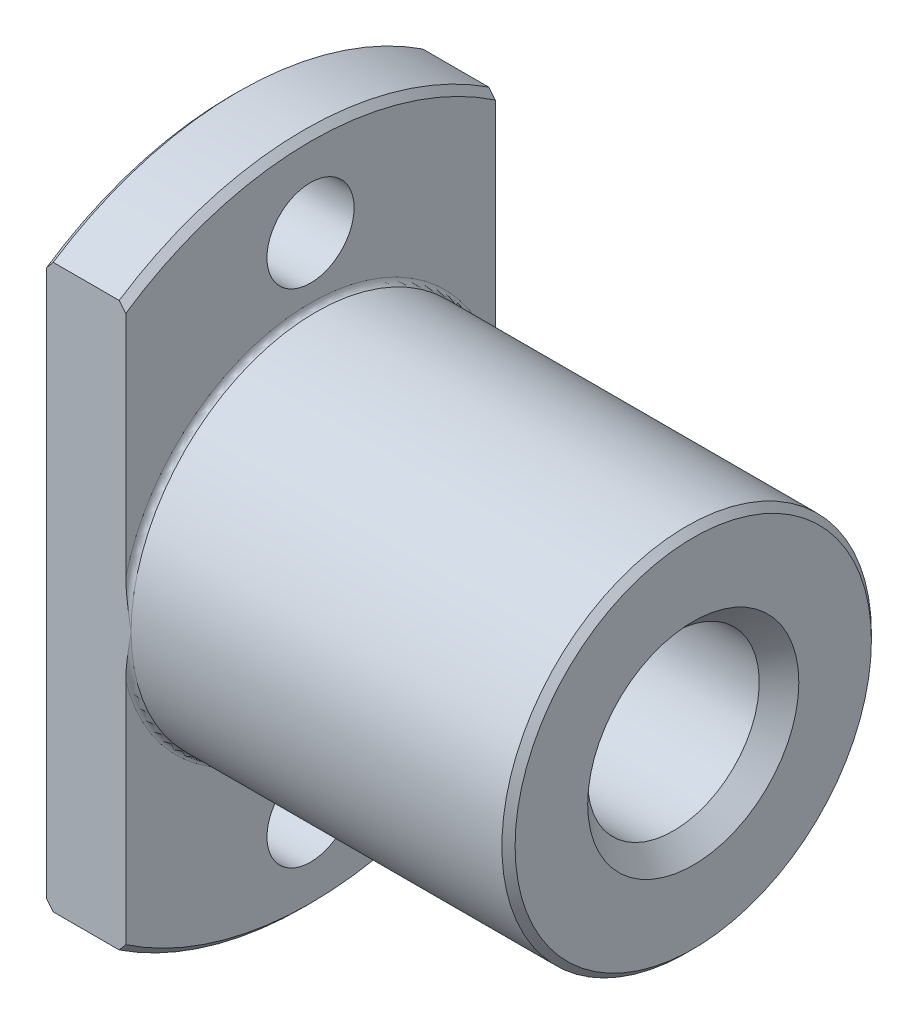
ISO-10303-21;
HEADER;
FILE_DESCRIPTION(('STEP AP214'),'2;1');
FILE_NAME('part.step','',(''),(''),'','','');
FILE_SCHEMA(('AUTOMOTIVE_DESIGN { 1 0 10303 214 1 1 1 1 }'));
ENDSEC;
DATA;
#1=APPLICATION_CONTEXT('core data for automotive mechanical design processes');
#2=APPLICATION_PROTOCOL_DEFINITION('international standard','automotive_design',2000,#1);
#3=PRODUCT_CONTEXT('',#1,'mechanical');
#4=PRODUCT('Part','Part','',(#3));
#5=PRODUCT_RELATED_PRODUCT_CATEGORY('part','',(#4));
#6=PRODUCT_DEFINITION_FORMATION('','',#4);
#7=PRODUCT_DEFINITION_CONTEXT('part definition',#1,'design');
#8=PRODUCT_DEFINITION('design','',#6,#7);
#9=PRODUCT_DEFINITION_SHAPE('','',#8);
#10=(LENGTH_UNIT() NAMED_UNIT(*) SI_UNIT(.MILLI.,.METRE.));
#11=(NAMED_UNIT(*) PLANE_ANGLE_UNIT() SI_UNIT($,.RADIAN.));
#12=(NAMED_UNIT(*) SI_UNIT($,.STERADIAN.) SOLID_ANGLE_UNIT());
#13=UNCERTAINTY_MEASURE_WITH_UNIT(LENGTH_MEASURE(1.E-05),#10,'distance_accuracy_value','');
#14=(GEOMETRIC_REPRESENTATION_CONTEXT(3) GLOBAL_UNCERTAINTY_ASSIGNED_CONTEXT((#13)) GLOBAL_UNIT_ASSIGNED_CONTEXT((#10,
#11,#12)) REPRESENTATION_CONTEXT('',''));
#15=CARTESIAN_POINT('',(0.,0.,0.));
#16=DIRECTION('',(0.,0.,1.));
#17=DIRECTION('',(1.,0.,0.));
#18=AXIS2_PLACEMENT_3D('',#15,#16,#17);
#19=CARTESIAN_POINT('',(0.499999999999405,0.,0.));
#20=DIRECTION('',(1.,0.,0.));
#21=DIRECTION('',(0.,-0.828492607116294,0.559999999958613));
#22=AXIS2_PLACEMENT_3D('',#19,#20,#21);
#23=CONICAL_SURFACE('',#22,25.4999999999994,0.785398163397448);
#24=CARTESIAN_POINT('',(0.,0.,0.));
#25=DIRECTION('',(1.,0.,0.));
#26=DIRECTION('',(0.,-0.828492607116294,0.559999999958613));
#27=AXIS2_PLACEMENT_3D('',#24,#25,#26);
#28=CIRCLE('',#27,25.);
#29=CARTESIAN_POINT('',(0.,-20.7123151779073,13.9999999989653));
#30=VERTEX_POINT('',#29);
#31=CARTESIAN_POINT('',(0.,-20.712315177208,-14.));
#32=VERTEX_POINT('',#31);
#33=EDGE_CURVE('E113',#30,#32,#28,.T.);
#34=ORIENTED_EDGE('',*,*,#33,.T.);
#35=CARTESIAN_POINT('',(0.,-20.712315177208,-14.));
#36=CARTESIAN_POINT('',(0.0207764515539653,-20.7373925900107,-14.0000000000205));
#37=CARTESIAN_POINT('',(0.0415599192445983,-20.7624641898695,-14.0000000000796));
#38=CARTESIAN_POINT('',(0.0831421654218376,-20.8125975546564,-14.0000000001959));
#39=CARTESIAN_POINT('',(0.103940944849708,-20.8376593188039,-14.000000000253));
#40=CARTESIAN_POINT('',(0.14555328530448,-20.8877726185182,-14.0000000002862));
#41=CARTESIAN_POINT('',(0.166366846997098,-20.9128241535322,-14.0000000002622));
#42=CARTESIAN_POINT('',(0.208008223217808,-20.9629166004068,-14.0000000001588));
#43=CARTESIAN_POINT('',(0.228836038140765,-20.9879575119392,-14.0000000000794));
#44=CARTESIAN_POINT('',(0.270505391929723,-21.038028316722,-13.9999999999206));
#45=CARTESIAN_POINT('',(0.291346930924344,-21.0630582098654,-13.9999999998413));
#46=CARTESIAN_POINT('',(0.33304320401818,-21.1131065820927,-13.9999999997382));
#47=CARTESIAN_POINT('',(0.353897937984325,-21.1381250612875,-13.9999999997145));
#48=CARTESIAN_POINT('',(0.395620072067997,-21.1881502093141,-13.9999999997478));
#49=CARTESIAN_POINT('',(0.416487471795262,-21.2131568784716,-13.9999999998049));
#50=CARTESIAN_POINT('',(0.458234408825642,-21.263158009309,-13.9999999999208));
#51=CARTESIAN_POINT('',(0.479113945485732,-21.2881524715259,-13.9999999999797));
#52=CARTESIAN_POINT('',(0.499999999999404,-21.3131414859464,-14.));
#53=B_SPLINE_CURVE_WITH_KNOTS('',3,(#35,#36,#37,#38,#39,#40,#41,#42,#43,#44,#45,#46,#47,#48,#49,
#50,#51,#52),.UNSPECIFIED.,.F.,.F.,(4,2,2,2,2,2,2,2,4),(0.,0.0976976861112168,0.195401986195182,
0.293111007579408,0.390822855304759,0.48853563218424,0.58624743886064,0.683956373863065,
0.781660533662384),.UNSPECIFIED.);
#54=CARTESIAN_POINT('',(0.499999999999404,-21.3131414859464,-14.));
#55=VERTEX_POINT('',#54);
#56=EDGE_CURVE('E99',#32,#55,#53,.T.);
#57=ORIENTED_EDGE('',*,*,#56,.T.);
#58=CARTESIAN_POINT('',(0.499999999999404,0.,0.));
#59=DIRECTION('',(-1.,0.,0.));
#60=DIRECTION('',(0.,-0.835809470037133,-0.54901960784315));
#61=AXIS2_PLACEMENT_3D('',#58,#59,#60);
#62=CIRCLE('',#61,25.4999999999994);
#63=CARTESIAN_POINT('',(0.499999999999404,-21.3131414859448,14.0000000000024));
#64=VERTEX_POINT('',#63);
#65=EDGE_CURVE('E112',#64,#55,#62,.F.);
#66=ORIENTED_EDGE('',*,*,#65,.F.);
#67=CARTESIAN_POINT('',(0.499999999996271,-21.3131414859422,14.0000000000007));
#68=CARTESIAN_POINT('',(0.479113247198307,-21.2881516360594,13.9999999999857));
#69=CARTESIAN_POINT('',(0.458233012689595,-21.2631563380162,13.9999999999317));
#70=CARTESIAN_POINT('',(0.41648488490307,-21.2131537791928,13.9999999998241));
#71=CARTESIAN_POINT('',(0.395616992139673,-21.1881465179832,13.9999999997706));
#72=CARTESIAN_POINT('',(0.353894074221933,-21.1381204270477,13.9999999997427));
#73=CARTESIAN_POINT('',(0.333039049329527,-21.1131015971034,13.9999999997683));
#74=CARTESIAN_POINT('',(0.291342393918546,-21.0630527621024,13.9999999998733));
#75=CARTESIAN_POINT('',(0.27050076340502,-21.0380227570415,13.9999999999528));
#76=CARTESIAN_POINT('',(0.22883142341076,-20.9879519646805,14.0000000001106));
#77=CARTESIAN_POINT('',(0.208003713673707,-20.9629111775936,14.0000000001889));
#78=CARTESIAN_POINT('',(0.166362741954434,-20.9128192133995,14.0000000002891));
#79=CARTESIAN_POINT('',(0.145549479449991,-20.8877680367262,14.000000000311));
#80=CARTESIAN_POINT('',(0.103937928798313,-20.8376556850171,14.0000000002727));
#81=CARTESIAN_POINT('',(0.0831396398583682,-20.8125945106394,14.0000000002126));
#82=CARTESIAN_POINT('',(0.0415585633807263,-20.7624625542513,14.000000000089));
#83=CARTESIAN_POINT('',(0.0207757747751494,-20.7373917731267,14.0000000000256));
#84=CARTESIAN_POINT('',(1.8476476858903E-09,-20.7123151794381,14.));
#85=B_SPLINE_CURVE_WITH_KNOTS('',3,(#67,#68,#69,#70,#71,#72,#73,#74,#75,#76,#77,#78,#79,#80,#81,
#82,#83,#84),.UNSPECIFIED.,.F.,.F.,(4,2,2,2,2,2,2,2,4),(0.,0.0977074263544266,0.195418672738843,
0.293131846513834,0.390845057093864,0.488556416002452,0.586264036928512,0.68396603578371,
0.781660530761051),.UNSPECIFIED.);
#86=EDGE_CURVE('E127',#64,#30,#85,.T.);
#87=ORIENTED_EDGE('',*,*,#86,.T.);
#88=EDGE_LOOP('',(#34,#57,#66,#87));
#89=FACE_BOUND('',#88,.T.);
#90=ADVANCED_FACE('F16',(#89),#23,.T.);
#91=CARTESIAN_POINT('',(35.,0.,0.));
#92=DIRECTION('',(1.,0.,0.));
#93=DIRECTION('',(0.,-0.835809470037071,0.549019607843245));
#94=AXIS2_PLACEMENT_3D('',#91,#92,#93);
#95=CYLINDRICAL_SURFACE('',#94,25.5);
#96=ORIENTED_EDGE('',*,*,#65,.T.);
#97=DIRECTION('',(1.,0.,0.));
#98=VECTOR('',#97,1.);
#99=CARTESIAN_POINT('',(0.499999999999403,-21.3131414859469,-14.0000000000003));
#100=LINE('',#99,#98);
#101=CARTESIAN_POINT('',(5.50000000000091,-21.3131414859468,-14.0000000000005));
#102=VERTEX_POINT('',#101);
#103=EDGE_CURVE('E106',#55,#102,#100,.T.);
#104=ORIENTED_EDGE('',*,*,#103,.T.);
#105=CARTESIAN_POINT('',(5.50000000000091,0.,0.));
#106=DIRECTION('',(-1.,0.,0.));
#107=DIRECTION('',(0.,-0.835809470037129,-0.549019607843157));
#108=AXIS2_PLACEMENT_3D('',#105,#106,#107);
#109=CIRCLE('',#108,25.5);
#110=CARTESIAN_POINT('',(5.50000000000091,-21.3131414859469,14.0000000000003));
#111=VERTEX_POINT('',#110);
#112=EDGE_CURVE('E159',#111,#102,#109,.F.);
#113=ORIENTED_EDGE('',*,*,#112,.F.);
#114=DIRECTION('',(-1.,3.23296944770491E-13,4.9240611588121E-13));
#115=VECTOR('',#114,1.);
#116=CARTESIAN_POINT('',(5.5000000000005,-21.3131414859469,14.0000000000003));
#117=LINE('',#116,#115);
#118=EDGE_CURVE('E164',#111,#64,#117,.T.);
#119=ORIENTED_EDGE('',*,*,#118,.T.);
#120=EDGE_LOOP('',(#96,#104,#113,#119));
#121=FACE_BOUND('',#120,.T.);
#122=ADVANCED_FACE('F146',(#121),#95,.T.);
#123=CARTESIAN_POINT('',(5.50000000000037,0.,0.));
#124=DIRECTION('',(-1.,0.,0.));
#125=DIRECTION('',(0.,-0.828492607120559,-0.559999999952302));
#126=AXIS2_PLACEMENT_3D('',#123,#124,#125);
#127=CONICAL_SURFACE('',#126,25.4999999999996,0.785398163397446);
#128=ORIENTED_EDGE('',*,*,#112,.T.);
#129=CARTESIAN_POINT('',(5.50000000000068,-21.3131414859462,-14.0000000000001));
#130=CARTESIAN_POINT('',(5.52088675278705,-21.2881516360775,-13.9999999999849));
#131=CARTESIAN_POINT('',(5.54176698728416,-21.2631563380483,-13.9999999999306));
#132=CARTESIAN_POINT('',(5.58351511504746,-21.2131537792531,-13.9999999998226));
#133=CARTESIAN_POINT('',(5.60438300779923,-21.1881465180576,-13.9999999997689));
#134=CARTESIAN_POINT('',(5.64610592569371,-21.1381204271502,-13.9999999997407));
#135=CARTESIAN_POINT('',(5.66696095057448,-21.1131015972199,-13.9999999997662));
#136=CARTESIAN_POINT('',(5.70865760596218,-21.0630527622471,-13.9999999998711));
#137=CARTESIAN_POINT('',(5.72949923646407,-21.0380227572002,-13.9999999999506));
#138=CARTESIAN_POINT('',(5.77116857643506,-20.9879519648672,-14.0000000001085));
#139=CARTESIAN_POINT('',(5.79199628616048,-20.9629111777944,-14.0000000001868));
#140=CARTESIAN_POINT('',(5.83363725785651,-20.9128192136282,-14.0000000002872));
#141=CARTESIAN_POINT('',(5.85445052034934,-20.887768036969,-14.0000000003092));
#142=CARTESIAN_POINT('',(5.89606207097782,-20.8376556852877,-14.0000000002713));
#143=CARTESIAN_POINT('',(5.91686035990617,-20.8125945109239,-14.0000000002114));
#144=CARTESIAN_POINT('',(5.95844143636067,-20.7624625545636,-14.0000000000884));
#145=CARTESIAN_POINT('',(5.9792242249547,-20.7373917734528,-14.0000000000253));
#146=CARTESIAN_POINT('',(5.99999999787064,-20.7123151797781,-14.));
#147=B_SPLINE_CURVE_WITH_KNOTS('',3,(#129,#130,#131,#132,#133,#134,#135,#136,#137,#138,#139,
#140,#141,#142,#143,#144,#145,#146),.UNSPECIFIED.,.F.,.F.,(4,2,2,2,2,2,2,2,4),(0.,
0.0977074262997272,0.195418672629386,0.293131846349614,0.390845056874921,0.488556415728873,
0.586264036600422,0.68396603540129,0.781660530324517),.UNSPECIFIED.);
#148=CARTESIAN_POINT('',(6.,-20.712315178014,-13.9999999988076));
#149=VERTEX_POINT('',#148);
#150=EDGE_CURVE('E169',#102,#149,#147,.T.);
#151=ORIENTED_EDGE('',*,*,#150,.T.);
#152=CARTESIAN_POINT('',(6.,0.,0.));
#153=DIRECTION('',(-1.,0.,0.));
#154=DIRECTION('',(0.,-0.828492607120559,-0.559999999952302));
#155=AXIS2_PLACEMENT_3D('',#152,#153,#154);
#156=CIRCLE('',#155,25.);
#157=CARTESIAN_POINT('',(6.,-20.712315177208,14.));
#158=VERTEX_POINT('',#157);
#159=EDGE_CURVE('E180',#158,#149,#156,.F.);
#160=ORIENTED_EDGE('',*,*,#159,.F.);
#161=CARTESIAN_POINT('',(6.,-20.712315177208,14.));
#162=CARTESIAN_POINT('',(5.97922354844607,-20.7373925900106,14.0000000000205));
#163=CARTESIAN_POINT('',(5.95844008075548,-20.7624641898694,14.0000000000796));
#164=CARTESIAN_POINT('',(5.91685783457828,-20.8125975546563,14.0000000001959));
#165=CARTESIAN_POINT('',(5.89605905515041,-20.8376593188038,14.0000000002531));
#166=CARTESIAN_POINT('',(5.85444671469561,-20.8877726185181,14.0000000002862));
#167=CARTESIAN_POINT('',(5.83363315300296,-20.9128241535321,14.0000000002622));
#168=CARTESIAN_POINT('',(5.79199177678217,-20.9629166004068,14.0000000001588));
#169=CARTESIAN_POINT('',(5.77116396185918,-20.9879575119392,14.0000000000794));
#170=CARTESIAN_POINT('',(5.72949460807013,-21.0380283167222,13.9999999999207));
#171=CARTESIAN_POINT('',(5.70865306907547,-21.0630582098656,13.9999999998414));
#172=CARTESIAN_POINT('',(5.66695679598156,-21.113106582093,13.9999999997383));
#173=CARTESIAN_POINT('',(5.64610206201538,-21.1381250612878,13.9999999997145));
#174=CARTESIAN_POINT('',(5.60437992793167,-21.1881502093145,13.9999999997478));
#175=CARTESIAN_POINT('',(5.58351252820441,-21.2131568784719,13.9999999998049));
#176=CARTESIAN_POINT('',(5.54176559117406,-21.2631580093093,13.9999999999209));
#177=CARTESIAN_POINT('',(5.52088605451401,-21.2881524715261,13.9999999999798));
#178=CARTESIAN_POINT('',(5.50000000000037,-21.3131414859466,14.0000000000001));
#179=B_SPLINE_CURVE_WITH_KNOTS('',3,(#161,#162,#163,#164,#165,#166,#167,#168,#169,#170,#171,
#172,#173,#174,#175,#176,#177,#178),.UNSPECIFIED.,.F.,.F.,(4,2,2,2,2,2,2,2,4),(0.,
0.097697686111021,0.195401986194994,0.293111007579348,0.390822855304899,0.488535632184585,
0.586247438861121,0.683956373863554,0.781660533662693),.UNSPECIFIED.);
#180=EDGE_CURVE('E209',#158,#111,#179,.T.);
#181=ORIENTED_EDGE('',*,*,#180,.T.);
#182=EDGE_LOOP('',(#128,#151,#160,#181));
#183=FACE_BOUND('',#182,.T.);
#184=ADVANCED_FACE('F182',(#183),#127,.T.);
#185=CARTESIAN_POINT('',(6.,-25.0000000017144,-14.));
#186=DIRECTION('',(1.,0.,0.));
#187=DIRECTION('',(0.,1.,0.));
#188=AXIS2_PLACEMENT_3D('',#185,#186,#187);
#189=PLANE('',#188);
#190=ORIENTED_EDGE('',*,*,#159,.T.);
#191=DIRECTION('',(0.,1.,0.));
#192=VECTOR('',#191,1.);
#193=CARTESIAN_POINT('',(6.,-20.7123151797781,-14.));
#194=LINE('',#193,#192);
#195=CARTESIAN_POINT('',(6.,-3.37045994540488,-14.));
#196=VERTEX_POINT('',#195);
#197=EDGE_CURVE('E200',#149,#196,#194,.T.);
#198=ORIENTED_EDGE('',*,*,#197,.T.);
#199=CARTESIAN_POINT('',(6.,0.,0.));
#200=DIRECTION('',(-1.,0.,0.));
#201=DIRECTION('',(0.,-0.234059718293423,-0.972222221651204));
#202=AXIS2_PLACEMENT_3D('',#199,#200,#201);
#203=CIRCLE('',#202,14.4000000412947);
#204=CARTESIAN_POINT('',(6.,-3.37046007545168,14.0000000024669));
#205=VERTEX_POINT('',#204);
#206=EDGE_CURVE('E208',#205,#196,#203,.F.);
#207=ORIENTED_EDGE('',*,*,#206,.F.);
#208=DIRECTION('',(0.,-1.,0.));
#209=VECTOR('',#208,1.);
#210=CARTESIAN_POINT('',(6.,-3.37046007485777,14.));
#211=LINE('',#210,#209);
#212=EDGE_CURVE('E214',#205,#158,#211,.T.);
#213=ORIENTED_EDGE('',*,*,#212,.T.);
#214=EDGE_LOOP('',(#190,#198,#207,#213));
#215=FACE_BOUND('',#214,.T.);
#216=CARTESIAN_POINT('',(6.,-19.,0.));
#217=DIRECTION('',(-1.,0.,0.));
#218=DIRECTION('',(0.,0.,-1.));
#219=AXIS2_PLACEMENT_3D('',#216,#217,#218);
#220=CIRCLE('',#219,3.3);
#221=CARTESIAN_POINT('',(6.,-19.,-3.3));
#222=VERTEX_POINT('',#221);
#223=EDGE_CURVE('E219',#222,#222,#220,.F.);
#224=ORIENTED_EDGE('',*,*,#223,.F.);
#225=EDGE_LOOP('',(#224));
#226=FACE_BOUND('',#225,.T.);
#227=ADVANCED_FACE('F191',(#215,#226),#189,.T.);
#228=CARTESIAN_POINT('',(6.39999999999938,0.,0.));
#229=DIRECTION('',(1.,0.,0.));
#230=DIRECTION('',(0.,0.,1.));
#231=AXIS2_PLACEMENT_3D('',#228,#229,#230);
#232=TOROIDAL_SURFACE('',#231,14.3999999999994,0.399999999999383);
#233=ORIENTED_EDGE('',*,*,#206,.T.);
#234=CARTESIAN_POINT('',(6.,-3.37045994540488,-14.));
#235=CARTESIAN_POINT('',(6.00001199548021,-3.3019342984978,-14.0000020840903));
#236=CARTESIAN_POINT('',(6.00096411883622,-3.23341540150265,-14.0000069486083));
#237=CARTESIAN_POINT('',(6.0045649171859,-3.09423312842194,-14.0000168041844));
#238=CARTESIAN_POINT('',(6.007266761912,-3.02357109433435,-14.0000217943269));
#239=CARTESIAN_POINT('',(6.0142284018148,-2.8807708548042,-14.0000256449359));
#240=CARTESIAN_POINT('',(6.01852110625671,-2.80863430837604,-14.00002436839));
#241=CARTESIAN_POINT('',(6.02850608897532,-2.6635309759947,-14.000017897332));
#242=CARTESIAN_POINT('',(6.03421558476385,-2.59056538678142,-14.0000126528602));
#243=CARTESIAN_POINT('',(6.04684196246574,-2.44443414979246,-14.0000017206226));
#244=CARTESIAN_POINT('',(6.05376376531026,-2.37126893143813,-13.9999960311045));
#245=CARTESIAN_POINT('',(6.06860356224121,-2.22535307948301,-13.9999875109145));
#246=CARTESIAN_POINT('',(6.07651721699287,-2.15260200163584,-13.9999846682472));
#247=CARTESIAN_POINT('',(6.09311751993652,-2.00811672331483,-13.99998288052));
#248=CARTESIAN_POINT('',(6.10179317993433,-1.93638125352284,-13.9999838868325));
#249=CARTESIAN_POINT('',(6.11968979260832,-1.79452005943164,-13.9999888028308));
#250=CARTESIAN_POINT('',(6.12889532874875,-1.72439238224327,-13.9999926506511));
#251=CARTESIAN_POINT('',(6.14763395845667,-1.58630631036396,-13.9999978495603));
#252=CARTESIAN_POINT('',(6.15714914626011,-1.51834547770449,-13.9999992715563));
#253=CARTESIAN_POINT('',(6.176615147099,-1.38288119283514,-14.0000007728122));
#254=CARTESIAN_POINT('',(6.18656317253572,-1.31537733891754,-14.0000008596683));
#255=CARTESIAN_POINT('',(6.20698568216251,-1.17963173664275,-14.0000014769856));
#256=CARTESIAN_POINT('',(6.2174650062542,-1.11139071823519,-14.0000020126887));
#257=CARTESIAN_POINT('',(6.23886922070522,-0.974303620495062,-14.0000025252452));
#258=CARTESIAN_POINT('',(6.24979743643951,-0.90545806155438,-14.0000024966522));
#259=CARTESIAN_POINT('',(6.27201355977399,-0.767291538827652,-14.0000021839038));
#260=CARTESIAN_POINT('',(6.28330356091112,-0.69797091242104,-14.0000018978194));
#261=CARTESIAN_POINT('',(6.30615471682222,-0.558981495776463,-14.0000012608565));
#262=CARTESIAN_POINT('',(6.31771702418588,-0.489312895424487,-14.0000009096291));
#263=CARTESIAN_POINT('',(6.34102183740367,-0.349752885400569,-14.0000003765134));
#264=CARTESIAN_POINT('',(6.35276483557448,-0.279861558145215,-14.0000001952277));
#265=CARTESIAN_POINT('',(6.37633874738332,-0.139980163940773,-13.9999999863575));
#266=CARTESIAN_POINT('',(6.38816977060455,-0.0699901154403926,-13.9999999590162));
#267=CARTESIAN_POINT('',(6.39999999999954,0.,-14.));
#268=B_SPLINE_CURVE_WITH_KNOTS('',3,(#234,#235,#236,#237,#238,#239,#240,#241,#242,#243,#244,
#245,#246,#247,#248,#249,#250,#251,#252,#253,#254,#255,#256,#257,#258,#259,#260,#261,#262,#263,
#264,#265,#266,#267),.UNSPECIFIED.,.F.,.F.,(4,2,2,2,2,2,2,2,2,2,2,2,2,2,2,2,4),(0.,
0.205560956527259,0.417681648119563,0.63446045339531,0.854015083562403,1.07448249523406,
1.2940169964309,1.51078714542077,1.72297194575961,1.92884098690511,2.13353832039423,
2.34066011479056,2.54978192987893,2.76048347311392,2.97234784794462,3.18496073351481,
3.3979095138643),.UNSPECIFIED.);
#269=CARTESIAN_POINT('',(6.39999999999954,0.,-14.));
#270=VERTEX_POINT('',#269);
#271=EDGE_CURVE('E224',#196,#270,#268,.T.);
#272=ORIENTED_EDGE('',*,*,#271,.T.);
#273=CARTESIAN_POINT('',(6.39999999999954,0.,0.));
#274=DIRECTION('',(-1.,0.,0.));
#275=DIRECTION('',(0.,0.,-1.));
#276=AXIS2_PLACEMENT_3D('',#273,#274,#275);
#277=CIRCLE('',#276,14.);
#278=CARTESIAN_POINT('',(6.39999999999954,0.,14.));
#279=VERTEX_POINT('',#278);
#280=EDGE_CURVE('E233',#279,#270,#277,.F.);
#281=ORIENTED_EDGE('',*,*,#280,.F.);
#282=CARTESIAN_POINT('',(6.39999999999984,0.,14.));
#283=CARTESIAN_POINT('',(6.38758921224068,-0.0734276151248544,14.0000001463741));
#284=CARTESIAN_POINT('',(6.37517917557478,-0.146855441635416,13.9999999566074));
#285=CARTESIAN_POINT('',(6.35030191173671,-0.294545045882363,13.9999993023027));
#286=CARTESIAN_POINT('',(6.33783559431114,-0.368806976692691,13.999998834719));
#287=CARTESIAN_POINT('',(6.31297886204904,-0.517892724583124,13.9999980341931));
#288=CARTESIAN_POINT('',(6.30058963830252,-0.592716740807022,13.9999977022436));
#289=CARTESIAN_POINT('',(6.27602640522691,-0.742655206101763,13.9999977847889));
#290=CARTESIAN_POINT('',(6.26385324665391,-0.817769794887734,13.9999982017648));
#291=CARTESIAN_POINT('',(6.23986395210174,-0.968016917928702,13.9999998365794));
#292=CARTESIAN_POINT('',(6.22804763760098,-1.04314942360213,14.0000010540105));
#293=CARTESIAN_POINT('',(6.20491385304079,-1.19315729290814,14.0000037219838));
#294=CARTESIAN_POINT('',(6.1935944390687,-1.26803235587974,14.0000051714904));
#295=CARTESIAN_POINT('',(6.1715933809221,-1.41724609520561,14.0000072880336));
#296=CARTESIAN_POINT('',(6.16090725035265,-1.49158410796147,14.000007961419));
#297=CARTESIAN_POINT('',(6.14030587351966,-1.63943890239359,14.0000078136721));
#298=CARTESIAN_POINT('',(6.13038278701876,-1.71295458783578,14.0000070107482));
#299=CARTESIAN_POINT('',(6.11143238326035,-1.85887307964716,14.0000039741963));
#300=CARTESIAN_POINT('',(6.10239302306752,-1.93127431597775,14.000001764302));
#301=CARTESIAN_POINT('',(6.08532389171154,-2.07465636360537,13.9999998558974));
#302=CARTESIAN_POINT('',(6.07727692248373,-2.14563511840796,14.0000001056876));
#303=CARTESIAN_POINT('',(6.06229228354908,-2.28590197084464,14.0000043763422));
#304=CARTESIAN_POINT('',(6.05533177581114,-2.35518761522392,14.00000830205));
#305=CARTESIAN_POINT('',(6.0425970745944,-2.49190808471307,14.0000160095064));
#306=CARTESIAN_POINT('',(6.0367950784332,-2.5593403032211,14.0000197922039));
#307=CARTESIAN_POINT('',(6.02644169555857,-2.69219405580088,14.000024936833));
#308=CARTESIAN_POINT('',(6.02185705675588,-2.75761297486051,14.0000263703177));
#309=CARTESIAN_POINT('',(6.01399264473003,-2.88627281735054,14.0000256936868));
#310=CARTESIAN_POINT('',(6.01067343397361,-2.9495113073195,14.0000237036891));
#311=CARTESIAN_POINT('',(6.00537950664984,-3.07363681458816,14.0000168145081));
#312=CARTESIAN_POINT('',(6.00335845942475,-3.13452179764983,14.0000120288395));
#313=CARTESIAN_POINT('',(6.00069938581939,-3.25375741061097,14.0000040342315));
#314=CARTESIAN_POINT('',(6.00000672855666,-3.31210684963121,14.0000007674058));
#315=CARTESIAN_POINT('',(6.,-3.37046007485777,14.));
#316=B_SPLINE_CURVE_WITH_KNOTS('',3,(#282,#283,#284,#285,#286,#287,#288,#289,#290,#291,#292,
#293,#294,#295,#296,#297,#298,#299,#300,#301,#302,#303,#304,#305,#306,#307,#308,#309,#310,#311,
#312,#313,#314,#315),.UNSPECIFIED.,.F.,.F.,(4,2,2,2,2,2,2,2,2,2,2,2,2,2,2,2,4),(0.,
0.223407348770703,0.449310338269671,0.676838358414336,0.905121530829563,1.13328853960588,
1.36046444258873,1.58576855062832,1.80831246555987,2.02719836917487,2.24149355521817,
2.45039038107051,2.65342683397589,2.85015572415542,3.04012202406451,3.22286389604791,
3.39791416898308),.UNSPECIFIED.);
#317=EDGE_CURVE('E258',#279,#205,#316,.T.);
#318=ORIENTED_EDGE('',*,*,#317,.T.);
#319=EDGE_LOOP('',(#233,#272,#281,#318));
#320=FACE_BOUND('',#319,.T.);
#321=ADVANCED_FACE('F235',(#320),#232,.F.);
#322=CARTESIAN_POINT('',(0.,-26.4292282758045,14.));
#323=DIRECTION('',(-1.,0.,0.));
#324=DIRECTION('',(0.,1.,0.));
#325=AXIS2_PLACEMENT_3D('',#322,#323,#324);
#326=PLANE('',#325);
#327=CARTESIAN_POINT('',(0.,0.,0.));
#328=DIRECTION('',(-1.,0.,0.));
#329=DIRECTION('',(0.,0.82849260708832,0.559999999999999));
#330=AXIS2_PLACEMENT_3D('',#327,#328,#329);
#331=CIRCLE('',#330,25.);
#332=CARTESIAN_POINT('',(0.,20.7123151772998,-13.9999999998642));
#333=VERTEX_POINT('',#332);
#334=CARTESIAN_POINT('',(0.,20.712315177208,14.));
#335=VERTEX_POINT('',#334);
#336=EDGE_CURVE('E123',#333,#335,#331,.F.);
#337=ORIENTED_EDGE('',*,*,#336,.F.);
#338=DIRECTION('',(0.,-1.,0.));
#339=VECTOR('',#338,1.);
#340=CARTESIAN_POINT('',(0.,20.7123151775006,-14.));
#341=LINE('',#340,#339);
#342=EDGE_CURVE('E103',#333,#32,#341,.T.);
#343=ORIENTED_EDGE('',*,*,#342,.T.);
#344=ORIENTED_EDGE('',*,*,#33,.F.);
#345=DIRECTION('',(0.,1.,0.));
#346=VECTOR('',#345,1.);
#347=CARTESIAN_POINT('',(0.,-20.7123151794381,14.));
#348=LINE('',#347,#346);
#349=EDGE_CURVE('E124',#30,#335,#348,.T.);
#350=ORIENTED_EDGE('',*,*,#349,.T.);
#351=EDGE_LOOP('',(#337,#343,#344,#350));
#352=FACE_BOUND('',#351,.T.);
#353=CARTESIAN_POINT('',(0.,0.,0.));
#354=DIRECTION('',(1.,0.,0.));
#355=DIRECTION('',(0.,0.,1.));
#356=AXIS2_PLACEMENT_3D('',#353,#354,#355);
#357=CIRCLE('',#356,8.);
#358=CARTESIAN_POINT('',(0.,0.,8.));
#359=VERTEX_POINT('',#358);
#360=EDGE_CURVE('E264',#359,#359,#357,.T.);
#361=ORIENTED_EDGE('',*,*,#360,.T.);
#362=EDGE_LOOP('',(#361));
#363=FACE_BOUND('',#362,.T.);
#364=CARTESIAN_POINT('',(0.,-19.,0.));
#365=DIRECTION('',(1.,0.,0.));
#366=DIRECTION('',(0.,-1.42053905339062E-07,0.99999999999999));
#367=AXIS2_PLACEMENT_3D('',#364,#365,#366);
#368=CIRCLE('',#367,3.3);
#369=CARTESIAN_POINT('',(0.,-19.0000004687779,3.29999999999997));
#370=VERTEX_POINT('',#369);
#371=EDGE_CURVE('E269',#370,#370,#368,.T.);
#372=ORIENTED_EDGE('',*,*,#371,.T.);
#373=EDGE_LOOP('',(#372));
#374=FACE_BOUND('',#373,.T.);
#375=CARTESIAN_POINT('',(0.,19.,0.));
#376=DIRECTION('',(1.,0.,0.));
#377=DIRECTION('',(0.,-1.42053902109323E-07,0.99999999999999));
#378=AXIS2_PLACEMENT_3D('',#375,#376,#377);
#379=CIRCLE('',#378,3.3);
#380=CARTESIAN_POINT('',(0.,18.9999995312221,3.29999999999997));
#381=VERTEX_POINT('',#380);
#382=EDGE_CURVE('E272',#381,#381,#379,.T.);
#383=ORIENTED_EDGE('',*,*,#382,.T.);
#384=EDGE_LOOP('',(#383));
#385=FACE_BOUND('',#384,.T.);
#386=ADVANCED_FACE('F119',(#352,#363,#374,#385),#326,.T.);
#387=CARTESIAN_POINT('',(0.499999999999408,0.,0.));
#388=DIRECTION('',(1.,0.,0.));
#389=DIRECTION('',(0.,0.82849260709199,-0.559999999994569));
#390=AXIS2_PLACEMENT_3D('',#387,#388,#389);
#391=CONICAL_SURFACE('',#390,25.4999999999994,0.78539816339745);
#392=ORIENTED_EDGE('',*,*,#336,.T.);
#393=CARTESIAN_POINT('',(0.,20.712315177208,14.));
#394=CARTESIAN_POINT('',(0.0207764515540626,20.7373925900108,14.0000000000205));
#395=CARTESIAN_POINT('',(0.0415599192447904,20.7624641898697,14.0000000000796));
#396=CARTESIAN_POINT('',(0.0831421654221373,20.8125975546568,14.0000000001959));
#397=CARTESIAN_POINT('',(0.10394094485002,20.8376593188043,14.000000000253));
#398=CARTESIAN_POINT('',(0.145553285304764,20.8877726185185,14.0000000002862));
#399=CARTESIAN_POINT('',(0.16636684699734,20.9128241535325,14.0000000002622));
#400=CARTESIAN_POINT('',(0.208008223217939,20.962916600407,14.0000000001588));
#401=CARTESIAN_POINT('',(0.228836038140826,20.9879575119393,14.0000000000794));
#402=CARTESIAN_POINT('',(0.270505391929646,21.0380283167219,13.9999999999206));
#403=CARTESIAN_POINT('',(0.291346930924198,21.0630582098653,13.9999999998413));
#404=CARTESIAN_POINT('',(0.333043204017925,21.1131065820924,13.9999999997382));
#405=CARTESIAN_POINT('',(0.35389793798403,21.1381250612871,13.9999999997145));
#406=CARTESIAN_POINT('',(0.395620072067676,21.1881502093138,13.9999999997478));
#407=CARTESIAN_POINT('',(0.416487471794957,21.2131568784712,13.9999999998049));
#408=CARTESIAN_POINT('',(0.458234408825451,21.2631580093088,13.9999999999208));
#409=CARTESIAN_POINT('',(0.479113945485639,21.2881524715257,13.9999999999797));
#410=CARTESIAN_POINT('',(0.499999999999408,21.3131414859464,14.));
#411=B_SPLINE_CURVE_WITH_KNOTS('',3,(#393,#394,#395,#396,#397,#398,#399,#400,#401,#402,#403,
#404,#405,#406,#407,#408,#409,#410),.UNSPECIFIED.,.F.,.F.,(4,2,2,2,2,2,2,2,4),(0.,
0.0976976861116702,0.195401986195692,0.293111007579717,0.390822855304748,0.488535632183908,
0.586247438860114,0.683956373862602,0.781660533662378),.UNSPECIFIED.);
#412=CARTESIAN_POINT('',(0.499999999999408,21.3131414859464,14.));
#413=VERTEX_POINT('',#412);
#414=EDGE_CURVE('E275',#335,#413,#411,.T.);
#415=ORIENTED_EDGE('',*,*,#414,.T.);
#416=CARTESIAN_POINT('',(0.499999999999408,0.,0.));
#417=DIRECTION('',(-1.,0.,0.));
#418=DIRECTION('',(0.,0.835809470037133,0.54901960784315));
#419=AXIS2_PLACEMENT_3D('',#416,#417,#418);
#420=CIRCLE('',#419,25.4999999999994);
#421=CARTESIAN_POINT('',(0.499999999999408,21.3131414859448,-14.0000000000024));
#422=VERTEX_POINT('',#421);
#423=EDGE_CURVE('E284',#422,#413,#420,.F.);
#424=ORIENTED_EDGE('',*,*,#423,.F.);
#425=CARTESIAN_POINT('',(0.499999999996271,21.3131414859422,-14.0000000000007));
#426=CARTESIAN_POINT('',(0.479113247128792,21.288151635976,-13.9999999999862));
#427=CARTESIAN_POINT('',(0.458233012550538,21.2631563378493,-13.9999999999323));
#428=CARTESIAN_POINT('',(0.416484884624952,21.2131537788592,-13.9999999998247));
#429=CARTESIAN_POINT('',(0.395616991792035,21.1881465175663,-13.9999999997709));
#430=CARTESIAN_POINT('',(0.353894073735285,21.1381204264645,-13.999999999742));
#431=CARTESIAN_POINT('',(0.333039048773388,21.113101596437,-13.9999999997669));
#432=CARTESIAN_POINT('',(0.291342393223465,21.06305276127,-13.9999999998701));
#433=CARTESIAN_POINT('',(0.270500762640487,21.0380227561261,-13.9999999999484));
#434=CARTESIAN_POINT('',(0.228831422507371,20.9879519635994,-14.0000000001034));
#435=CARTESIAN_POINT('',(0.208003712700914,20.9629111764298,-14.00000000018));
#436=CARTESIAN_POINT('',(0.166362740842884,20.9128192120703,-14.0000000002765));
#437=CARTESIAN_POINT('',(0.145549478269088,20.8877680353145,-14.0000000002962));
#438=CARTESIAN_POINT('',(0.103937927478771,20.8376556834404,-14.0000000002533));
#439=CARTESIAN_POINT('',(0.0831396384695379,20.8125945089804,-14.0000000001905));
#440=CARTESIAN_POINT('',(0.0415585618533915,20.7624625524278,-14.0000000000614));
#441=CARTESIAN_POINT('',(0.0207757731785975,20.7373917712211,-13.9999999999949));
#442=CARTESIAN_POINT('',(1.81840978906445E-10,20.7123151774504,-13.9999999999661));
#443=B_SPLINE_CURVE_WITH_KNOTS('',3,(#425,#426,#427,#428,#429,#430,#431,#432,#433,#434,#435,
#436,#437,#438,#439,#440,#441,#442),.UNSPECIFIED.,.F.,.F.,(4,2,2,2,2,2,2,2,4),(0.,
0.0977074266802537,0.195418673390113,0.293131847490112,0.39084505839468,0.488556417627296,
0.586264038876816,0.683966038054888,0.781660533354453),.UNSPECIFIED.);
#444=EDGE_CURVE('E312',#422,#333,#443,.T.);
#445=ORIENTED_EDGE('',*,*,#444,.T.);
#446=EDGE_LOOP('',(#392,#415,#424,#445));
#447=FACE_BOUND('',#446,.T.);
#448=ADVANCED_FACE('F286',(#447),#391,.T.);
#449=CARTESIAN_POINT('',(35.,0.,0.));
#450=DIRECTION('',(1.,0.,0.));
#451=DIRECTION('',(0.,0.835809470037071,-0.549019607843245));
#452=AXIS2_PLACEMENT_3D('',#449,#450,#451);
#453=CYLINDRICAL_SURFACE('',#452,25.5);
#454=CARTESIAN_POINT('',(5.50000000000091,0.,0.));
#455=DIRECTION('',(-1.,0.,0.));
#456=DIRECTION('',(0.,0.835809470037129,0.549019607843158));
#457=AXIS2_PLACEMENT_3D('',#454,#455,#456);
#458=CIRCLE('',#457,25.5);
#459=CARTESIAN_POINT('',(5.50000000000091,21.3131414859469,-14.0000000000003));
#460=VERTEX_POINT('',#459);
#461=CARTESIAN_POINT('',(5.50000000000091,21.3131414859468,14.0000000000005));
#462=VERTEX_POINT('',#461);
#463=EDGE_CURVE('E303',#460,#462,#458,.F.);
#464=ORIENTED_EDGE('',*,*,#463,.F.);
#465=DIRECTION('',(-1.,-3.2471803024201E-13,-4.94182472720608E-13));
#466=VECTOR('',#465,1.);
#467=CARTESIAN_POINT('',(5.5000000000005,21.3131414859469,-14.0000000000003));
#468=LINE('',#467,#466);
#469=EDGE_CURVE('E311',#460,#422,#468,.T.);
#470=ORIENTED_EDGE('',*,*,#469,.T.);
#471=ORIENTED_EDGE('',*,*,#423,.T.);
#472=DIRECTION('',(1.,0.,0.));
#473=VECTOR('',#472,1.);
#474=CARTESIAN_POINT('',(0.49999999999941,21.3131414859469,14.0000000000003));
#475=LINE('',#474,#473);
#476=EDGE_CURVE('E317',#413,#462,#475,.T.);
#477=ORIENTED_EDGE('',*,*,#476,.T.);
#478=EDGE_LOOP('',(#464,#470,#471,#477));
#479=FACE_BOUND('',#478,.T.);
#480=ADVANCED_FACE('F295',(#479),#453,.T.);
#481=CARTESIAN_POINT('',(5.50000000000037,0.,0.));
#482=DIRECTION('',(-1.,0.,0.));
#483=DIRECTION('',(0.,0.828492607120559,0.559999999952302));
#484=AXIS2_PLACEMENT_3D('',#481,#482,#483);
#485=CONICAL_SURFACE('',#484,25.4999999999996,0.785398163397447);
#486=CARTESIAN_POINT('',(6.,0.,0.));
#487=DIRECTION('',(-1.,0.,0.));
#488=DIRECTION('',(0.,0.828492607120559,0.559999999952302));
#489=AXIS2_PLACEMENT_3D('',#486,#487,#488);
#490=CIRCLE('',#489,25.);
#491=CARTESIAN_POINT('',(6.,20.712315177208,-14.));
#492=VERTEX_POINT('',#491);
#493=CARTESIAN_POINT('',(6.,20.712315178014,13.9999999988076));
#494=VERTEX_POINT('',#493);
#495=EDGE_CURVE('E322',#492,#494,#490,.F.);
#496=ORIENTED_EDGE('',*,*,#495,.F.);
#497=CARTESIAN_POINT('',(6.,20.712315177208,-14.));
#498=CARTESIAN_POINT('',(5.97922354844589,20.7373925900108,-14.0000000000204));
#499=CARTESIAN_POINT('',(5.95844008075512,20.7624641898698,-14.0000000000796));
#500=CARTESIAN_POINT('',(5.9168578345777,20.812597554657,-14.0000000001959));
#501=CARTESIAN_POINT('',(5.8960590551498,20.8376593188045,-14.000000000253));
#502=CARTESIAN_POINT('',(5.85444671469505,20.8877726185188,-14.0000000002862));
#503=CARTESIAN_POINT('',(5.83363315300248,20.9128241535327,-14.0000000002622));
#504=CARTESIAN_POINT('',(5.79199177678191,20.9629166004072,-14.0000000001588));
#505=CARTESIAN_POINT('',(5.77116396185904,20.9879575119394,-14.0000000000794));
#506=CARTESIAN_POINT('',(5.72949460807025,21.038028316722,-13.9999999999207));
#507=CARTESIAN_POINT('',(5.70865306907572,21.0630582098653,-13.9999999998414));
#508=CARTESIAN_POINT('',(5.66695679598201,21.1131065820925,-13.9999999997383));
#509=CARTESIAN_POINT('',(5.64610206201592,21.1381250612871,-13.9999999997145));
#510=CARTESIAN_POINT('',(5.60437992793226,21.1881502093138,-13.9999999997478));
#511=CARTESIAN_POINT('',(5.58351252820497,21.2131568784713,-13.9999999998049));
#512=CARTESIAN_POINT('',(5.54176559117442,21.2631580093089,-13.9999999999209));
#513=CARTESIAN_POINT('',(5.52088605451419,21.2881524715259,-13.9999999999798));
#514=CARTESIAN_POINT('',(5.50000000000037,21.3131414859466,-14.0000000000001));
#515=B_SPLINE_CURVE_WITH_KNOTS('',3,(#497,#498,#499,#500,#501,#502,#503,#504,#505,#506,#507,
#508,#509,#510,#511,#512,#513,#514),.UNSPECIFIED.,.F.,.F.,(4,2,2,2,2,2,2,2,4),(0.,
0.0976976861118842,0.195401986195976,0.293111007579977,0.390822855304919,0.488535632183998,
0.58624743886016,0.683956373862711,0.78166053366269),.UNSPECIFIED.);
#516=EDGE_CURVE('E327',#492,#460,#515,.T.);
#517=ORIENTED_EDGE('',*,*,#516,.T.);
#518=ORIENTED_EDGE('',*,*,#463,.T.);
#519=CARTESIAN_POINT('',(5.50000000000068,21.3131414859462,14.0000000000001));
#520=CARTESIAN_POINT('',(5.52088675278706,21.2881516360775,13.9999999999849));
#521=CARTESIAN_POINT('',(5.54176698728417,21.2631563380483,13.9999999999306));
#522=CARTESIAN_POINT('',(5.58351511504748,21.2131537792531,13.9999999998226));
#523=CARTESIAN_POINT('',(5.60438300779925,21.1881465180575,13.9999999997689));
#524=CARTESIAN_POINT('',(5.64610592569372,21.1381204271502,13.9999999997407));
#525=CARTESIAN_POINT('',(5.66696095057449,21.1131015972199,13.9999999997662));
#526=CARTESIAN_POINT('',(5.70865760596219,21.063052762247,13.9999999998711));
#527=CARTESIAN_POINT('',(5.72949923646407,21.0380227572002,13.9999999999506));
#528=CARTESIAN_POINT('',(5.77116857643505,20.9879519648673,14.0000000001085));
#529=CARTESIAN_POINT('',(5.79199628616046,20.9629111777944,14.0000000001868));
#530=CARTESIAN_POINT('',(5.83363725785648,20.9128192136283,14.0000000002872));
#531=CARTESIAN_POINT('',(5.85445052034931,20.887768036969,14.0000000003092));
#532=CARTESIAN_POINT('',(5.89606207097778,20.8376556852877,14.0000000002713));
#533=CARTESIAN_POINT('',(5.91686035990614,20.812594510924,14.0000000002114));
#534=CARTESIAN_POINT('',(5.95844143636065,20.7624625545636,14.0000000000884));
#535=CARTESIAN_POINT('',(5.97922422495468,20.7373917734528,14.0000000000253));
#536=CARTESIAN_POINT('',(5.99999999787064,20.7123151797781,14.));
#537=B_SPLINE_CURVE_WITH_KNOTS('',3,(#519,#520,#521,#522,#523,#524,#525,#526,#527,#528,#529,
#530,#531,#532,#533,#534,#535,#536),.UNSPECIFIED.,.F.,.F.,(4,2,2,2,2,2,2,2,4),(0.,
0.0977074262997571,0.195418672629422,0.293131846349629,0.390845056874908,0.488556415728832,
0.586264036600366,0.683966035401243,0.78166053032451),.UNSPECIFIED.);
#538=EDGE_CURVE('E363',#462,#494,#537,.T.);
#539=ORIENTED_EDGE('',*,*,#538,.T.);
#540=EDGE_LOOP('',(#496,#517,#518,#539));
#541=FACE_BOUND('',#540,.T.);
#542=ADVANCED_FACE('F340',(#541),#485,.T.);
#543=CARTESIAN_POINT('',(6.,3.37045994540487,-14.));
#544=DIRECTION('',(1.,0.,0.));
#545=DIRECTION('',(0.,1.,0.));
#546=AXIS2_PLACEMENT_3D('',#543,#544,#545);
#547=PLANE('',#546);
#548=CARTESIAN_POINT('',(6.,0.,0.));
#549=DIRECTION('',(-1.,0.,0.));
#550=DIRECTION('',(0.,0.234059718293423,0.972222221651204));
#551=AXIS2_PLACEMENT_3D('',#548,#549,#550);
#552=CIRCLE('',#551,14.4000000412947);
#553=CARTESIAN_POINT('',(6.,3.37046007545167,-14.0000000024669));
#554=VERTEX_POINT('',#553);
#555=CARTESIAN_POINT('',(6.,3.37045995309072,14.000000031925));
#556=VERTEX_POINT('',#555);
#557=EDGE_CURVE('E355',#554,#556,#552,.F.);
#558=ORIENTED_EDGE('',*,*,#557,.F.);
#559=DIRECTION('',(0.,1.,0.));
#560=VECTOR('',#559,1.);
#561=CARTESIAN_POINT('',(6.,3.37046007485776,-14.));
#562=LINE('',#561,#560);
#563=EDGE_CURVE('E40',#554,#492,#562,.T.);
#564=ORIENTED_EDGE('',*,*,#563,.T.);
#565=ORIENTED_EDGE('',*,*,#495,.T.);
#566=DIRECTION('',(0.,-1.,0.));
#567=VECTOR('',#566,1.);
#568=CARTESIAN_POINT('',(6.,20.7123151797781,14.));
#569=LINE('',#568,#567);
#570=EDGE_CURVE('E367',#494,#556,#569,.T.);
#571=ORIENTED_EDGE('',*,*,#570,.T.);
#572=EDGE_LOOP('',(#558,#564,#565,#571));
#573=FACE_BOUND('',#572,.T.);
#574=CARTESIAN_POINT('',(6.,19.,0.));
#575=DIRECTION('',(-1.,0.,0.));
#576=DIRECTION('',(0.,-1.42053897803003E-07,-0.99999999999999));
#577=AXIS2_PLACEMENT_3D('',#574,#575,#576);
#578=CIRCLE('',#577,3.3);
#579=CARTESIAN_POINT('',(6.,18.9999995312221,-3.29999999999997));
#580=VERTEX_POINT('',#579);
#581=EDGE_CURVE('E371',#580,#580,#578,.F.);
#582=ORIENTED_EDGE('',*,*,#581,.F.);
#583=EDGE_LOOP('',(#582));
#584=FACE_BOUND('',#583,.T.);
#585=ADVANCED_FACE('F349',(#573,#584),#547,.T.);
#586=CARTESIAN_POINT('',(6.39999999999938,0.,0.));
#587=DIRECTION('',(1.,0.,0.));
#588=DIRECTION('',(0.,0.,-1.));
#589=AXIS2_PLACEMENT_3D('',#586,#587,#588);
#590=TOROIDAL_SURFACE('',#589,14.3999999999994,0.399999999999383);
#591=ORIENTED_EDGE('',*,*,#557,.T.);
#592=CARTESIAN_POINT('',(6.,3.37045994540487,14.));
#593=CARTESIAN_POINT('',(6.00001199548025,3.30193429844552,14.0000020840903));
#594=CARTESIAN_POINT('',(6.00096411883769,3.23341540139811,14.0000069486083));
#595=CARTESIAN_POINT('',(6.00456491719267,3.09423312821017,14.0000168041844));
#596=CARTESIAN_POINT('',(6.00726676192274,3.02357109406762,14.0000217943269));
#597=CARTESIAN_POINT('',(6.01422840183554,2.88077085442629,14.0000256449359));
#598=CARTESIAN_POINT('',(6.01852110628355,2.80863430794194,14.0000243683899));
#599=CARTESIAN_POINT('',(6.02850608901603,2.66353097544838,14.0000178973319));
#600=CARTESIAN_POINT('',(6.03421558481234,2.5905653861791,14.0000126528601));
#601=CARTESIAN_POINT('',(6.04684196253097,2.44443414907968,14.0000017206225));
#602=CARTESIAN_POINT('',(6.05376376538444,2.37126893067091,13.9999960311044));
#603=CARTESIAN_POINT('',(6.06860356233395,2.2253530786098,13.9999875109143));
#604=CARTESIAN_POINT('',(6.0765172170952,2.15260200071108,13.9999846682471));
#605=CARTESIAN_POINT('',(6.09311752005814,2.00811672229119,13.9999828805199));
#606=CARTESIAN_POINT('',(6.10179318006563,1.93638125245186,13.9999838868324));
#607=CARTESIAN_POINT('',(6.11968979275861,1.79452005827148,13.9999888028308));
#608=CARTESIAN_POINT('',(6.12889532890832,1.72439238104127,13.9999926506511));
#609=CARTESIAN_POINT('',(6.14763395863418,1.58630630908281,13.9999978495603));
#610=CARTESIAN_POINT('',(6.15714914644626,1.51834547638603,13.9999992715563));
#611=CARTESIAN_POINT('',(6.17661514729753,1.38288119147897,14.000000772812));
#612=CARTESIAN_POINT('',(6.18656317273774,1.31537733756094,14.0000008596679));
#613=CARTESIAN_POINT('',(6.20698568236092,1.17963173535341,14.0000014769847));
#614=CARTESIAN_POINT('',(6.2174650064451,1.11139071701349,14.0000020126876));
#615=CARTESIAN_POINT('',(6.23886922087347,0.974303619448596,14.000002525244));
#616=CARTESIAN_POINT('',(6.2497974365924,0.905458060615492,14.000002496651));
#617=CARTESIAN_POINT('',(6.27201355989269,0.767291538116102,14.0000021839027));
#618=CARTESIAN_POINT('',(6.28330356101092,0.69797091182924,14.0000018978185));
#619=CARTESIAN_POINT('',(6.30615471688563,0.558981495408784,14.0000012608559));
#620=CARTESIAN_POINT('',(6.31771702423183,0.489312895161187,14.0000009096287));
#621=CARTESIAN_POINT('',(6.34102183742136,0.349752885303229,14.0000003765132));
#622=CARTESIAN_POINT('',(6.35276483558147,0.279861558109471,14.0000001952276));
#623=CARTESIAN_POINT('',(6.37633874738083,0.139980163957988,13.9999999863575));
#624=CARTESIAN_POINT('',(6.38816977060335,0.069990115448982,13.9999999590162));
#625=CARTESIAN_POINT('',(6.39999999999984,0.,14.));
#626=B_SPLINE_CURVE_WITH_KNOTS('',3,(#592,#593,#594,#595,#596,#597,#598,#599,#600,#601,#602,
#603,#604,#605,#606,#607,#608,#609,#610,#611,#612,#613,#614,#615,#616,#617,#618,#619,#620,#621,
#622,#623,#624,#625),.UNSPECIFIED.,.F.,.F.,(4,2,2,2,2,2,2,2,2,2,2,2,2,2,2,2,4),(0.,
0.205560956684038,0.41768164844154,0.634460453886656,0.85401508422306,1.07448249605985,
1.29401699741353,1.51078714654789,1.72297194701479,1.92884098827475,2.13353832176667,
2.34066011595905,2.54978193072146,2.76048347359276,2.97234784810598,3.18496073348861,
3.39790951386426),.UNSPECIFIED.);
#627=EDGE_CURVE('E31',#556,#279,#626,.T.);
#628=ORIENTED_EDGE('',*,*,#627,.T.);
#629=CARTESIAN_POINT('',(6.39999999999984,0.,0.));
#630=DIRECTION('',(-1.,0.,0.));
#631=DIRECTION('',(0.,0.,1.));
#632=AXIS2_PLACEMENT_3D('',#629,#630,#631);
#633=CIRCLE('',#632,14.);
#634=EDGE_CURVE('E382',#270,#279,#633,.F.);
#635=ORIENTED_EDGE('',*,*,#634,.F.);
#636=CARTESIAN_POINT('',(6.39999999999954,0.,-14.));
#637=CARTESIAN_POINT('',(6.38758921224037,0.0734276151248816,-14.0000001463741));
#638=CARTESIAN_POINT('',(6.37517917557447,0.146855441635468,-13.9999999566074));
#639=CARTESIAN_POINT('',(6.35030191173641,0.294545045882414,-13.9999993023027));
#640=CARTESIAN_POINT('',(6.33783559431086,0.368806976692715,-13.9999988347191));
#641=CARTESIAN_POINT('',(6.31297886204879,0.517892724583055,-13.9999980341932));
#642=CARTESIAN_POINT('',(6.30058963830229,0.592716740806888,-13.9999977022437));
#643=CARTESIAN_POINT('',(6.27602640522672,0.742655206101474,-13.999997784789));
#644=CARTESIAN_POINT('',(6.26385324665374,0.817769794887356,-13.9999982017649));
#645=CARTESIAN_POINT('',(6.23986395210162,0.968016917928136,-13.9999998365795));
#646=CARTESIAN_POINT('',(6.22804763760088,1.04314942360147,-14.0000010540106));
#647=CARTESIAN_POINT('',(6.20491385304074,1.19315729290728,-14.0000037219839));
#648=CARTESIAN_POINT('',(6.19359443906867,1.2680323558788,-14.0000051714905));
#649=CARTESIAN_POINT('',(6.17159338092211,1.41724609520449,-14.0000072880337));
#650=CARTESIAN_POINT('',(6.16090725035267,1.49158410796028,-14.0000079614191));
#651=CARTESIAN_POINT('',(6.14030587351971,1.63943890239229,-14.0000078136722));
#652=CARTESIAN_POINT('',(6.13038278701882,1.71295458783444,-14.0000070107483));
#653=CARTESIAN_POINT('',(6.11143238326042,1.85887307964579,-14.0000039741964));
#654=CARTESIAN_POINT('',(6.10239302306759,1.93127431597639,-14.0000017643021));
#655=CARTESIAN_POINT('',(6.0853238917116,2.07465636360409,-13.9999998558975));
#656=CARTESIAN_POINT('',(6.07727692248379,2.14563511840675,-14.0000001056877));
#657=CARTESIAN_POINT('',(6.06229228354913,2.28590197084357,-14.0000043763423));
#658=CARTESIAN_POINT('',(6.05533177581119,2.35518761522291,-14.0000083020501));
#659=CARTESIAN_POINT('',(6.04259707459444,2.4919080847122,-14.0000160095064));
#660=CARTESIAN_POINT('',(6.03679507843323,2.55934030322031,-14.000019792204));
#661=CARTESIAN_POINT('',(6.02644169555859,2.69219405580022,-14.000024936833));
#662=CARTESIAN_POINT('',(6.0218570567559,2.75761297485993,-14.0000263703178));
#663=CARTESIAN_POINT('',(6.01399264473004,2.88627281735009,-14.0000256936868));
#664=CARTESIAN_POINT('',(6.01067343397362,2.9495113073191,-14.0000237036891));
#665=CARTESIAN_POINT('',(6.00537950664984,3.07363681458788,-14.0000168145082));
#666=CARTESIAN_POINT('',(6.00335845942475,3.13452179764961,-14.0000120288395));
#667=CARTESIAN_POINT('',(6.00069938581939,3.25375741061086,-14.0000040342315));
#668=CARTESIAN_POINT('',(6.00000672855666,3.31210684963115,-14.0000007674059));
#669=CARTESIAN_POINT('',(6.,3.37046007485776,-14.));
#670=B_SPLINE_CURVE_WITH_KNOTS('',3,(#636,#637,#638,#639,#640,#641,#642,#643,#644,#645,#646,
#647,#648,#649,#650,#651,#652,#653,#654,#655,#656,#657,#658,#659,#660,#661,#662,#663,#664,#665,
#666,#667,#668,#669),.UNSPECIFIED.,.F.,.F.,(4,2,2,2,2,2,2,2,2,2,2,2,2,2,2,2,4),(0.,
0.223407348770779,0.44931033826966,0.676838358414122,0.905121530829074,1.13328853960508,
1.36046444258765,1.58576855062702,1.80831246555845,2.02719836917349,2.24149355521698,
2.45039038106953,2.65342683397513,2.85015572415485,3.04012202406414,3.22286389604771,
3.39791416898303),.UNSPECIFIED.);
#671=EDGE_CURVE('E410',#270,#554,#670,.T.);
#672=ORIENTED_EDGE('',*,*,#671,.T.);
#673=EDGE_LOOP('',(#591,#628,#635,#672));
#674=FACE_BOUND('',#673,.T.);
#675=ADVANCED_FACE('F384',(#674),#590,.F.);
#676=CARTESIAN_POINT('',(35.,-13.7507806405276,-13.5));
#677=DIRECTION('',(1.,0.,0.));
#678=DIRECTION('',(0.,1.,0.));
#679=AXIS2_PLACEMENT_3D('',#676,#677,#678);
#680=PLANE('',#679);
#681=CARTESIAN_POINT('',(35.,0.,0.));
#682=DIRECTION('',(1.,0.,0.));
#683=DIRECTION('',(0.,0.,1.));
#684=AXIS2_PLACEMENT_3D('',#681,#682,#683);
#685=CIRCLE('',#684,13.5);
#686=CARTESIAN_POINT('',(35.,0.,13.5));
#687=VERTEX_POINT('',#686);
#688=EDGE_CURVE('E401',#687,#687,#685,.T.);
#689=ORIENTED_EDGE('',*,*,#688,.T.);
#690=EDGE_LOOP('',(#689));
#691=FACE_BOUND('',#690,.T.);
#692=CARTESIAN_POINT('',(35.,0.,0.));
#693=DIRECTION('',(-1.,0.,0.));
#694=DIRECTION('',(0.,0.,-1.));
#695=AXIS2_PLACEMENT_3D('',#692,#693,#694);
#696=CIRCLE('',#695,8.);
#697=CARTESIAN_POINT('',(35.,0.,-8.));
#698=VERTEX_POINT('',#697);
#699=EDGE_CURVE('E409',#698,#698,#696,.F.);
#700=ORIENTED_EDGE('',*,*,#699,.F.);
#701=EDGE_LOOP('',(#700));
#702=FACE_BOUND('',#701,.T.);
#703=ADVANCED_FACE('F393',(#691,#702),#680,.T.);
#704=CARTESIAN_POINT('',(6.39999999999984,-21.3131414859467,14.));
#705=DIRECTION('',(0.,0.,1.));
#706=DIRECTION('',(0.,1.,0.));
#707=AXIS2_PLACEMENT_3D('',#704,#705,#706);
#708=PLANE('',#707);
#709=ORIENTED_EDGE('',*,*,#627,.F.);
#710=ORIENTED_EDGE('',*,*,#570,.F.);
#711=ORIENTED_EDGE('',*,*,#538,.F.);
#712=ORIENTED_EDGE('',*,*,#476,.F.);
#713=ORIENTED_EDGE('',*,*,#414,.F.);
#714=ORIENTED_EDGE('',*,*,#349,.F.);
#715=ORIENTED_EDGE('',*,*,#86,.F.);
#716=ORIENTED_EDGE('',*,*,#118,.F.);
#717=ORIENTED_EDGE('',*,*,#180,.F.);
#718=ORIENTED_EDGE('',*,*,#212,.F.);
#719=ORIENTED_EDGE('',*,*,#317,.F.);
#720=EDGE_LOOP('',(#709,#710,#711,#712,#713,#714,#715,#716,#717,#718,#719));
#721=FACE_BOUND('',#720,.T.);
#722=ADVANCED_FACE('F418',(#721),#708,.T.);
#723=CARTESIAN_POINT('',(0.,-21.3131414859464,-14.));
#724=DIRECTION('',(0.,0.,-1.));
#725=DIRECTION('',(0.,1.,0.));
#726=AXIS2_PLACEMENT_3D('',#723,#724,#725);
#727=PLANE('',#726);
#728=ORIENTED_EDGE('',*,*,#197,.F.);
#729=ORIENTED_EDGE('',*,*,#150,.F.);
#730=ORIENTED_EDGE('',*,*,#103,.F.);
#731=ORIENTED_EDGE('',*,*,#56,.F.);
#732=ORIENTED_EDGE('',*,*,#342,.F.);
#733=ORIENTED_EDGE('',*,*,#444,.F.);
#734=ORIENTED_EDGE('',*,*,#469,.F.);
#735=ORIENTED_EDGE('',*,*,#516,.F.);
#736=ORIENTED_EDGE('',*,*,#563,.F.);
#737=ORIENTED_EDGE('',*,*,#671,.F.);
#738=ORIENTED_EDGE('',*,*,#271,.F.);
#739=EDGE_LOOP('',(#728,#729,#730,#731,#732,#733,#734,#735,#736,#737,#738));
#740=FACE_BOUND('',#739,.T.);
#741=ADVANCED_FACE('F102',(#740),#727,.T.);
#742=CARTESIAN_POINT('',(35.,0.,0.));
#743=DIRECTION('',(1.,0.,0.));
#744=DIRECTION('',(0.,0.,1.));
#745=AXIS2_PLACEMENT_3D('',#742,#743,#744);
#746=CYLINDRICAL_SURFACE('',#745,14.);
#747=CARTESIAN_POINT('',(34.5,0.,0.));
#748=DIRECTION('',(-1.,0.,0.));
#749=DIRECTION('',(0.,0.,-1.));
#750=AXIS2_PLACEMENT_3D('',#747,#748,#749);
#751=CIRCLE('',#750,14.);
#752=CARTESIAN_POINT('',(34.5,0.,-14.));
#753=VERTEX_POINT('',#752);
#754=EDGE_CURVE('E412',#753,#753,#751,.F.);
#755=ORIENTED_EDGE('',*,*,#754,.F.);
#756=EDGE_LOOP('',(#755));
#757=FACE_BOUND('',#756,.T.);
#758=ORIENTED_EDGE('',*,*,#280,.T.);
#759=ORIENTED_EDGE('',*,*,#634,.T.);
#760=EDGE_LOOP('',(#758,#759));
#761=FACE_BOUND('',#760,.T.);
#762=ADVANCED_FACE('F462',(#757,#761),#746,.T.);
#763=CARTESIAN_POINT('',(34.5,0.,0.));
#764=DIRECTION('',(-1.,0.,0.));
#765=DIRECTION('',(0.,0.,-1.));
#766=AXIS2_PLACEMENT_3D('',#763,#764,#765);
#767=CONICAL_SURFACE('',#766,14.,0.785398163397448);
#768=ORIENTED_EDGE('',*,*,#688,.F.);
#769=EDGE_LOOP('',(#768));
#770=FACE_BOUND('',#769,.T.);
#771=ORIENTED_EDGE('',*,*,#754,.T.);
#772=EDGE_LOOP('',(#771));
#773=FACE_BOUND('',#772,.T.);
#774=ADVANCED_FACE('F525',(#770,#773),#767,.T.);
#775=CARTESIAN_POINT('',(0.,0.,0.));
#776=DIRECTION('',(-1.,0.,0.));
#777=DIRECTION('',(0.,0.,-1.));
#778=AXIS2_PLACEMENT_3D('',#775,#776,#777);
#779=CONICAL_SURFACE('',#778,8.,0.785398163397447);
#780=ORIENTED_EDGE('',*,*,#360,.F.);
#781=EDGE_LOOP('',(#780));
#782=FACE_BOUND('',#781,.T.);
#783=CARTESIAN_POINT('',(1.5,0.,0.));
#784=DIRECTION('',(1.,0.,0.));
#785=DIRECTION('',(0.,0.,1.));
#786=AXIS2_PLACEMENT_3D('',#783,#784,#785);
#787=CIRCLE('',#786,6.5);
#788=CARTESIAN_POINT('',(1.5,0.,6.5));
#789=VERTEX_POINT('',#788);
#790=EDGE_CURVE('E24',#789,#789,#787,.T.);
#791=ORIENTED_EDGE('',*,*,#790,.T.);
#792=EDGE_LOOP('',(#791));
#793=FACE_BOUND('',#792,.T.);
#794=ADVANCED_FACE('F510',(#782,#793),#779,.F.);
#795=CARTESIAN_POINT('',(35.,0.,0.));
#796=DIRECTION('',(1.,0.,0.));
#797=DIRECTION('',(0.,0.,1.));
#798=AXIS2_PLACEMENT_3D('',#795,#796,#797);
#799=CYLINDRICAL_SURFACE('',#798,6.5);
#800=CARTESIAN_POINT('',(33.5,0.,0.));
#801=DIRECTION('',(1.,0.,0.));
#802=DIRECTION('',(0.,-1.923402433919E-10,1.));
#803=AXIS2_PLACEMENT_3D('',#800,#801,#802);
#804=CIRCLE('',#803,6.5);
#805=CARTESIAN_POINT('',(33.5,-1.25021158204735E-09,6.5));
#806=VERTEX_POINT('',#805);
#807=EDGE_CURVE('E11',#806,#806,#804,.T.);
#808=ORIENTED_EDGE('',*,*,#807,.T.);
#809=EDGE_LOOP('',(#808));
#810=FACE_BOUND('',#809,.T.);
#811=ORIENTED_EDGE('',*,*,#790,.F.);
#812=EDGE_LOOP('',(#811));
#813=FACE_BOUND('',#812,.T.);
#814=ADVANCED_FACE('F512',(#810,#813),#799,.F.);
#815=CARTESIAN_POINT('',(35.,0.,0.));
#816=DIRECTION('',(1.,0.,0.));
#817=DIRECTION('',(0.,0.,1.));
#818=AXIS2_PLACEMENT_3D('',#815,#816,#817);
#819=CONICAL_SURFACE('',#818,8.,0.785398163397447);
#820=ORIENTED_EDGE('',*,*,#699,.T.);
#821=EDGE_LOOP('',(#820));
#822=FACE_BOUND('',#821,.T.);
#823=ORIENTED_EDGE('',*,*,#807,.F.);
#824=EDGE_LOOP('',(#823));
#825=FACE_BOUND('',#824,.T.);
#826=ADVANCED_FACE('F514',(#822,#825),#819,.F.);
#827=CARTESIAN_POINT('',(6.,19.,0.));
#828=DIRECTION('',(1.,0.,0.));
#829=DIRECTION('',(0.,0.,1.));
#830=AXIS2_PLACEMENT_3D('',#827,#828,#829);
#831=CYLINDRICAL_SURFACE('',#830,3.3);
#832=ORIENTED_EDGE('',*,*,#581,.T.);
#833=EDGE_LOOP('',(#832));
#834=FACE_BOUND('',#833,.T.);
#835=ORIENTED_EDGE('',*,*,#382,.F.);
#836=EDGE_LOOP('',(#835));
#837=FACE_BOUND('',#836,.T.);
#838=ADVANCED_FACE('F522',(#834,#837),#831,.F.);
#839=CARTESIAN_POINT('',(6.,-19.,0.));
#840=DIRECTION('',(1.,0.,0.));
#841=DIRECTION('',(0.,0.,1.));
#842=AXIS2_PLACEMENT_3D('',#839,#840,#841);
#843=CYLINDRICAL_SURFACE('',#842,3.3);
#844=ORIENTED_EDGE('',*,*,#223,.T.);
#845=EDGE_LOOP('',(#844));
#846=FACE_BOUND('',#845,.T.);
#847=ORIENTED_EDGE('',*,*,#371,.F.);
#848=EDGE_LOOP('',(#847));
#849=FACE_BOUND('',#848,.T.);
#850=ADVANCED_FACE('F18',(#846,#849),#843,.F.);
#851=CLOSED_SHELL('',(#90,#122,#184,#227,#321,#386,#448,#480,#542,#585,#675,#703,#722,#741,#762,
#774,#794,#814,#826,#838,#850));
#852=MANIFOLD_SOLID_BREP('B1',#851);
#853=ADVANCED_BREP_SHAPE_REPRESENTATION('',(#18,#852),#14);
#854=SHAPE_DEFINITION_REPRESENTATION(#9,#853);
ENDSEC;
END-ISO-10303-21;
